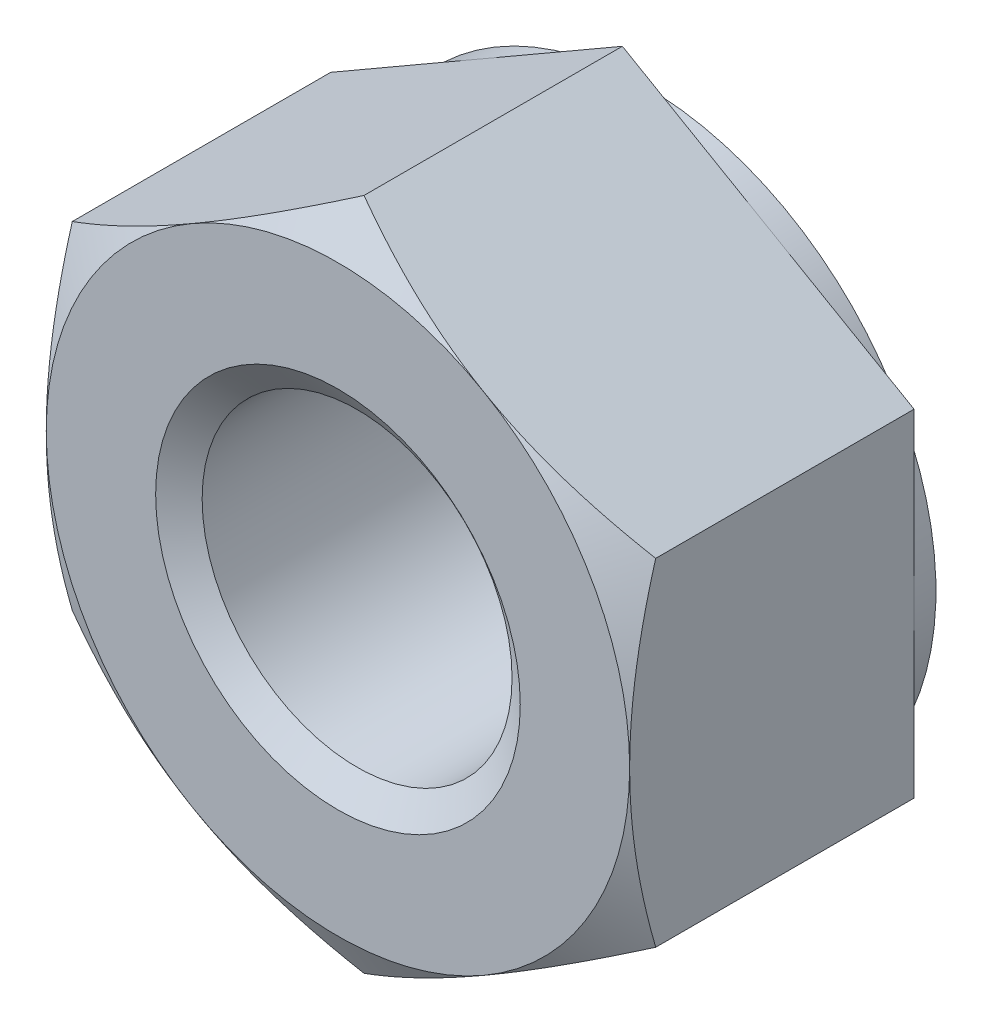
ISO-10303-21;
HEADER;
FILE_DESCRIPTION(('STEP AP214'),'2;1');
FILE_NAME('part.step','',(''),(''),'','','');
FILE_SCHEMA(('AUTOMOTIVE_DESIGN { 1 0 10303 214 1 1 1 1 }'));
ENDSEC;
DATA;
#1=APPLICATION_CONTEXT('core data for automotive mechanical design processes');
#2=APPLICATION_PROTOCOL_DEFINITION('international standard','automotive_design',2000,#1);
#3=PRODUCT_CONTEXT('',#1,'mechanical');
#4=PRODUCT('Part','Part','',(#3));
#5=PRODUCT_RELATED_PRODUCT_CATEGORY('part','',(#4));
#6=PRODUCT_DEFINITION_FORMATION('','',#4);
#7=PRODUCT_DEFINITION_CONTEXT('part definition',#1,'design');
#8=PRODUCT_DEFINITION('design','',#6,#7);
#9=PRODUCT_DEFINITION_SHAPE('','',#8);
#10=(LENGTH_UNIT() NAMED_UNIT(*) SI_UNIT(.MILLI.,.METRE.));
#11=(NAMED_UNIT(*) PLANE_ANGLE_UNIT() SI_UNIT($,.RADIAN.));
#12=(NAMED_UNIT(*) SI_UNIT($,.STERADIAN.) SOLID_ANGLE_UNIT());
#13=UNCERTAINTY_MEASURE_WITH_UNIT(LENGTH_MEASURE(1.E-05),#10,'distance_accuracy_value','');
#14=(GEOMETRIC_REPRESENTATION_CONTEXT(3) GLOBAL_UNCERTAINTY_ASSIGNED_CONTEXT((#13)) GLOBAL_UNIT_ASSIGNED_CONTEXT((#10,
#11,#12)) REPRESENTATION_CONTEXT('',''));
#15=CARTESIAN_POINT('',(0.,0.,0.));
#16=DIRECTION('',(0.,0.,1.));
#17=DIRECTION('',(1.,0.,0.));
#18=AXIS2_PLACEMENT_3D('',#15,#16,#17);
#19=CARTESIAN_POINT('',(0.,0.,-8.4));
#20=DIRECTION('',(0.,0.,1.));
#21=DIRECTION('',(1.,0.,0.));
#22=AXIS2_PLACEMENT_3D('',#19,#20,#21);
#23=CYLINDRICAL_SURFACE('',#22,4.25);
#24=CARTESIAN_POINT('',(0.,0.,-0.525155653657275));
#25=DIRECTION('',(0.,0.,1.));
#26=DIRECTION('',(1.,0.,0.));
#27=AXIS2_PLACEMENT_3D('',#24,#25,#26);
#28=CIRCLE('',#27,4.25);
#29=CARTESIAN_POINT('',(4.25,0.,-0.525155653657275));
#30=VERTEX_POINT('',#29);
#31=EDGE_CURVE('E153',#30,#30,#28,.F.);
#32=ORIENTED_EDGE('',*,*,#31,.F.);
#33=EDGE_LOOP('',(#32));
#34=FACE_BOUND('',#33,.T.);
#35=CARTESIAN_POINT('',(0.,0.,-7.84944434634271));
#36=DIRECTION('',(0.,0.,-1.));
#37=DIRECTION('',(-1.,0.,0.));
#38=AXIS2_PLACEMENT_3D('',#35,#36,#37);
#39=CIRCLE('',#38,4.25);
#40=CARTESIAN_POINT('',(-4.25,0.,-7.84944434634271));
#41=VERTEX_POINT('',#40);
#42=EDGE_CURVE('E41',#41,#41,#39,.F.);
#43=ORIENTED_EDGE('',*,*,#42,.F.);
#44=EDGE_LOOP('',(#43));
#45=FACE_BOUND('',#44,.T.);
#46=ADVANCED_FACE('F36',(#34,#45),#23,.F.);
#47=CARTESIAN_POINT('',(0.,9.23760430703403,-8.4));
#48=DIRECTION('',(-0.500000000000002,0.866025403784438,0.));
#49=DIRECTION('',(-0.866025403784438,-0.500000000000001,0.));
#50=AXIS2_PLACEMENT_3D('',#47,#48,#49);
#51=PLANE('',#50);
#52=DIRECTION('',(0.,0.,1.));
#53=VECTOR('',#52,1.);
#54=CARTESIAN_POINT('',(-8.,4.618802153517,-8.4));
#55=LINE('',#54,#53);
#56=CARTESIAN_POINT('',(-8.,4.618802153517,-7.8));
#57=VERTEX_POINT('',#56);
#58=CARTESIAN_POINT('',(-8.,4.618802153517,-0.714531179816336));
#59=VERTEX_POINT('',#58);
#60=EDGE_CURVE('E294',#57,#59,#55,.T.);
#61=ORIENTED_EDGE('',*,*,#60,.T.);
#62=CARTESIAN_POINT('',(-8.0002,4.61868668346316,-0.714597847732978));
#63=CARTESIAN_POINT('',(-7.8243512161201,4.72021302617289,-0.655990714047302));
#64=CARTESIAN_POINT('',(-7.64784680569387,4.82211789504563,-0.600043401047294));
#65=CARTESIAN_POINT('',(-7.29340453712154,5.02675523421805,-0.494201005024669));
#66=CARTESIAN_POINT('',(-7.11546609530729,5.12948804149869,-0.444308534431069));
#67=CARTESIAN_POINT('',(-6.57880176237736,5.43933133858026,-0.304692797206867));
#68=CARTESIAN_POINT('',(-6.21795741776428,5.64766491807817,-0.225281170978369));
#69=CARTESIAN_POINT('',(-5.67796082979595,5.95943209350317,-0.132161646294488));
#70=CARTESIAN_POINT('',(-5.50042181035672,6.06193429416807,-0.105634581029124));
#71=CARTESIAN_POINT('',(-5.1445408870398,6.26740224104455,-0.0611531748588751));
#72=CARTESIAN_POINT('',(-4.96619905550676,6.37036794548792,-0.0431980765145794));
#73=CARTESIAN_POINT('',(-4.60920831517641,6.57647664551585,-0.0163156484918648));
#74=CARTESIAN_POINT('',(-4.4305599863905,6.67961930623067,-0.00737807354623335));
#75=CARTESIAN_POINT('',(-4.07309829490262,6.88599991003618,0.00127769603487006));
#76=CARTESIAN_POINT('',(-3.89428493746993,6.98923785008464,0.000996175497150641));
#77=CARTESIAN_POINT('',(-3.5599866329831,7.18224506616975,-0.00814502526877564));
#78=CARTESIAN_POINT('',(-3.40447809566133,7.27202796205376,-0.0158896043673706));
#79=CARTESIAN_POINT('',(-3.09382523825949,7.45138347289924,-0.0382011348534298));
#80=CARTESIAN_POINT('',(-2.93868094344,7.54095607327651,-0.0527685461381488));
#81=CARTESIAN_POINT('',(-2.47384868410518,7.80932710333149,-0.106360690527538));
#82=CARTESIAN_POINT('',(-2.16498351281828,7.98765049311728,-0.155268641669147));
#83=CARTESIAN_POINT('',(-1.5439767712397,8.34618890253625,-0.277539403234319));
#84=CARTESIAN_POINT('',(-1.23191445788552,8.52635816315522,-0.351420520376005));
#85=CARTESIAN_POINT('',(-0.612443518305234,8.88400987687705,-0.51910014125498));
#86=CARTESIAN_POINT('',(-0.305026959108242,9.06149691008278,-0.612859260854464));
#87=CARTESIAN_POINT('',(0.000200000000006861,9.23771977708786,-0.714597847732986));
#88=B_SPLINE_CURVE_WITH_KNOTS('',3,(#62,#63,#64,#65,#66,#67,#68,#69,#70,#71,#72,#73,#74,#75,#76,
#77,#78,#79,#80,#81,#82,#83,#84,#85,#86,#87),.UNSPECIFIED.,.F.,.F.,(4,2,2,2,2,2,2,2,2,2,2,2,4),
(0.,0.633973543721351,1.26821965714356,2.53934712434766,3.15934343977049,3.77928496069784,
4.39852133866766,5.01773858515596,5.55680239410249,6.09590254421148,7.17487077411836,
8.27776850154294,9.37850115249056),.UNSPECIFIED.);
#89=CARTESIAN_POINT('',(-4.00000000000001,6.9282032302755,0.));
#90=VERTEX_POINT('',#89);
#91=EDGE_CURVE('E60',#59,#90,#88,.T.);
#92=ORIENTED_EDGE('',*,*,#91,.T.);
#93=CARTESIAN_POINT('',(0.,9.23760430703403,-0.714531179816336));
#94=VERTEX_POINT('',#93);
#95=EDGE_CURVE('E167',#90,#94,#88,.T.);
#96=ORIENTED_EDGE('',*,*,#95,.T.);
#97=DIRECTION('',(0.,0.,1.));
#98=VECTOR('',#97,1.);
#99=CARTESIAN_POINT('',(0.,9.23760430703403,-8.4));
#100=LINE('',#99,#98);
#101=CARTESIAN_POINT('',(0.,9.23760430703403,-7.8));
#102=VERTEX_POINT('',#101);
#103=EDGE_CURVE('E282',#102,#94,#100,.T.);
#104=ORIENTED_EDGE('',*,*,#103,.F.);
#105=DIRECTION('',(-0.866025403784438,-0.500000000000001,0.));
#106=VECTOR('',#105,1.);
#107=CARTESIAN_POINT('',(0.,9.23760430703403,-7.8));
#108=LINE('',#107,#106);
#109=CARTESIAN_POINT('',(-4.00000000000001,6.9282032302755,-7.80000000000001));
#110=VERTEX_POINT('',#109);
#111=EDGE_CURVE('E270',#102,#110,#108,.T.);
#112=ORIENTED_EDGE('',*,*,#111,.T.);
#113=EDGE_CURVE('E266',#110,#57,#108,.T.);
#114=ORIENTED_EDGE('',*,*,#113,.T.);
#115=EDGE_LOOP('',(#61,#92,#96,#104,#112,#114));
#116=FACE_BOUND('',#115,.T.);
#117=ADVANCED_FACE('F38',(#116),#51,.T.);
#118=CARTESIAN_POINT('',(8.,4.61880215351699,-8.4));
#119=DIRECTION('',(0.500000000000003,0.866025403784437,0.));
#120=DIRECTION('',(-0.866025403784437,0.500000000000003,0.));
#121=AXIS2_PLACEMENT_3D('',#118,#119,#120);
#122=PLANE('',#121);
#123=ORIENTED_EDGE('',*,*,#103,.T.);
#124=CARTESIAN_POINT('',(-0.000199999999993257,9.23771977708786,-0.714597847732987));
#125=CARTESIAN_POINT('',(0.175648783879903,9.13619343437814,-0.655990714047311));
#126=CARTESIAN_POINT('',(0.352153194306141,9.03428856550539,-0.600043401047303));
#127=CARTESIAN_POINT('',(0.706595462878466,8.82965122633298,-0.494201005024678));
#128=CARTESIAN_POINT('',(0.884533904692719,8.72691841905234,-0.444308534431077));
#129=CARTESIAN_POINT('',(1.42119823762265,8.41707512197076,-0.304692797206873));
#130=CARTESIAN_POINT('',(1.78204258223573,8.20874154247285,-0.225281170978374));
#131=CARTESIAN_POINT('',(2.32203917020406,7.89697436704785,-0.132161646294492));
#132=CARTESIAN_POINT('',(2.49957818964329,7.79447216638295,-0.105634581029128));
#133=CARTESIAN_POINT('',(2.85545911296021,7.58900421950647,-0.0611531748588782));
#134=CARTESIAN_POINT('',(3.03380094449325,7.4860385150631,-0.043198076514582));
#135=CARTESIAN_POINT('',(3.3907916848236,7.27992981503516,-0.0163156484918658));
#136=CARTESIAN_POINT('',(3.56944001360951,7.17678715432034,-0.00737807354623321));
#137=CARTESIAN_POINT('',(3.92690170509739,6.97040655051483,0.00127769603487092));
#138=CARTESIAN_POINT('',(4.10571506253007,6.86716861046637,0.000996175497151138));
#139=CARTESIAN_POINT('',(4.44001336701691,6.67416139438126,-0.00814502526877416));
#140=CARTESIAN_POINT('',(4.59552190433868,6.58437849849725,-0.0158896043673679));
#141=CARTESIAN_POINT('',(4.90617476174052,6.40502298765177,-0.038201134853426));
#142=CARTESIAN_POINT('',(5.06131905656001,6.31545038727451,-0.0527685461381451));
#143=CARTESIAN_POINT('',(5.52615131589482,6.04707935721953,-0.106360690527534));
#144=CARTESIAN_POINT('',(5.83501648718173,5.86875596743373,-0.155268641669143));
#145=CARTESIAN_POINT('',(6.45602322876031,5.51021755801476,-0.277539403234312));
#146=CARTESIAN_POINT('',(6.76808554211448,5.33004829739579,-0.351420520375997));
#147=CARTESIAN_POINT('',(7.38755648169477,4.97239658367396,-0.519100141254969));
#148=CARTESIAN_POINT('',(7.69497304089176,4.79490955046823,-0.612859260854453));
#149=CARTESIAN_POINT('',(8.00020000000001,4.61868668346315,-0.714597847732975));
#150=B_SPLINE_CURVE_WITH_KNOTS('',3,(#124,#125,#126,#127,#128,#129,#130,#131,#132,#133,#134,
#135,#136,#137,#138,#139,#140,#141,#142,#143,#144,#145,#146,#147,#148,#149),.UNSPECIFIED.,.F.,
.F.,(4,2,2,2,2,2,2,2,2,2,2,2,4),(0.,0.633973543721352,1.26821965714356,2.53934712434766,
3.1593434397705,3.77928496069785,4.39852133866767,5.01773858515596,5.5568023941025,
6.09590254421149,7.17487077411836,8.27776850154294,9.37850115249056),.UNSPECIFIED.);
#151=CARTESIAN_POINT('',(4.00000000000002,6.9282032302755,0.));
#152=VERTEX_POINT('',#151);
#153=EDGE_CURVE('E164',#94,#152,#150,.T.);
#154=ORIENTED_EDGE('',*,*,#153,.T.);
#155=CARTESIAN_POINT('',(8.,4.61880215351703,-0.714531179816336));
#156=VERTEX_POINT('',#155);
#157=EDGE_CURVE('E147',#152,#156,#150,.T.);
#158=ORIENTED_EDGE('',*,*,#157,.T.);
#159=DIRECTION('',(0.,0.,1.));
#160=VECTOR('',#159,1.);
#161=CARTESIAN_POINT('',(8.,4.61880215351699,-8.4));
#162=LINE('',#161,#160);
#163=CARTESIAN_POINT('',(8.,4.61880215351699,-7.8));
#164=VERTEX_POINT('',#163);
#165=EDGE_CURVE('E163',#164,#156,#162,.T.);
#166=ORIENTED_EDGE('',*,*,#165,.F.);
#167=DIRECTION('',(-0.866025403784437,0.500000000000003,0.));
#168=VECTOR('',#167,1.);
#169=CARTESIAN_POINT('',(8.,4.61880215351699,-7.8));
#170=LINE('',#169,#168);
#171=CARTESIAN_POINT('',(4.00000000000002,6.9282032302755,-7.80000000000001));
#172=VERTEX_POINT('',#171);
#173=EDGE_CURVE('E278',#164,#172,#170,.T.);
#174=ORIENTED_EDGE('',*,*,#173,.T.);
#175=EDGE_CURVE('E274',#172,#102,#170,.T.);
#176=ORIENTED_EDGE('',*,*,#175,.T.);
#177=EDGE_LOOP('',(#123,#154,#158,#166,#174,#176));
#178=FACE_BOUND('',#177,.T.);
#179=ADVANCED_FACE('F241',(#178),#122,.T.);
#180=CARTESIAN_POINT('',(8.,4.61880215351699,-8.4));
#181=DIRECTION('',(-1.,0.,0.));
#182=DIRECTION('',(0.,0.,1.));
#183=AXIS2_PLACEMENT_3D('',#180,#181,#182);
#184=PLANE('',#183);
#185=CARTESIAN_POINT('',(8.,-12.2497439799177,-3.82821364248122));
#186=CARTESIAN_POINT('',(8.,-11.8984987351193,-3.65847254218266));
#187=CARTESIAN_POINT('',(8.,-11.5464230390783,-3.49041880793923));
#188=CARTESIAN_POINT('',(8.,-10.8401616983868,-3.15865029326974));
#189=CARTESIAN_POINT('',(8.,-10.4859757012546,-2.99493626408528));
#190=CARTESIAN_POINT('',(8.,-9.77313142803814,-2.67194892676994));
#191=CARTESIAN_POINT('',(8.,-9.41445915782848,-2.51270639241668));
#192=CARTESIAN_POINT('',(8.,-8.69416671490287,-2.20106116855006));
#193=CARTESIAN_POINT('',(8.,-8.33254669701139,-2.04865812250699));
#194=CARTESIAN_POINT('',(8.,-7.60129405984857,-1.7507013094022));
#195=CARTESIAN_POINT('',(8.,-7.2316175748596,-1.60525460075004));
#196=CARTESIAN_POINT('',(8.,-6.48790521752629,-1.32575242959684));
#197=CARTESIAN_POINT('',(8.,-6.11386886541895,-1.19169823445334));
#198=CARTESIAN_POINT('',(8.,-5.36160531585215,-0.938583617279796));
#199=CARTESIAN_POINT('',(8.,-4.98338896232053,-0.819491318535674));
#200=CARTESIAN_POINT('',(8.,-4.2215930034141,-0.600166264263341));
#201=CARTESIAN_POINT('',(8.,-3.83801513546607,-0.499927544676865));
#202=CARTESIAN_POINT('',(8.,-3.06517005833209,-0.323183265030146));
#203=CARTESIAN_POINT('',(8.,-2.67590136311897,-0.246684024227884));
#204=CARTESIAN_POINT('',(8.,-2.08857290362252,-0.153570158514917));
#205=CARTESIAN_POINT('',(8.,-1.89220175174279,-0.126136015174347));
#206=CARTESIAN_POINT('',(8.,-1.49853877384916,-0.0790191845115878));
#207=CARTESIAN_POINT('',(8.,-1.3012470409403,-0.0593357297923793));
#208=CARTESIAN_POINT('',(8.,-0.907261125171482,-0.0282499846394219));
#209=CARTESIAN_POINT('',(8.,-0.710571016085392,-0.0167962708107608));
#210=CARTESIAN_POINT('',(8.,-0.316882268583081,-0.0022305633436852));
#211=CARTESIAN_POINT('',(8.,-0.119883634206744,0.000881538622463729));
#212=CARTESIAN_POINT('',(8.,0.274012171056974,-0.00131013187964857));
#213=CARTESIAN_POINT('',(8.,0.47090935490336,-0.00661154245623651));
#214=CARTESIAN_POINT('',(8.,0.8643086583796,-0.0254984060979545));
#215=CARTESIAN_POINT('',(8.,1.06081075778876,-0.0390842728575164));
#216=CARTESIAN_POINT('',(8.,1.53707134445822,-0.0817685231184888));
#217=CARTESIAN_POINT('',(8.,1.81646391313846,-0.115017715431789));
#218=CARTESIAN_POINT('',(8.,2.37310809107455,-0.196418304991677));
#219=CARTESIAN_POINT('',(8.,2.65035909476176,-0.244573769774452));
#220=CARTESIAN_POINT('',(8.,3.20249141370949,-0.354078983931477));
#221=CARTESIAN_POINT('',(8.,3.47737023104608,-0.41544120858484));
#222=CARTESIAN_POINT('',(8.,4.02429975324249,-0.549487708331676));
#223=CARTESIAN_POINT('',(8.,4.29635072195127,-0.622170916833577));
#224=CARTESIAN_POINT('',(8.,4.84432510211611,-0.779020451442163));
#225=CARTESIAN_POINT('',(8.,5.12017997476409,-0.863424582160065));
#226=CARTESIAN_POINT('',(8.,5.6689739270833,-1.04057245964238));
#227=CARTESIAN_POINT('',(8.,5.94191487461246,-1.13331045423936));
#228=CARTESIAN_POINT('',(8.,6.48378576423056,-1.32521046517734));
#229=CARTESIAN_POINT('',(8.,6.7527296356523,-1.42433338468805));
#230=CARTESIAN_POINT('',(8.,7.28853074702745,-1.628397174615));
#231=CARTESIAN_POINT('',(8.,7.55538709319937,-1.73334039644852));
#232=CARTESIAN_POINT('',(8.,7.82127397973352,-1.84061801308352));
#233=B_SPLINE_CURVE_WITH_KNOTS('',3,(#185,#186,#187,#188,#189,#190,#191,#192,#193,#194,#195,
#196,#197,#198,#199,#200,#201,#202,#203,#204,#205,#206,#207,#208,#209,#210,#211,#212,#213,#214,
#215,#216,#217,#218,#219,#220,#221,#222,#223,#224,#225,#226,#227,#228,#229,#230,#231,#232),
.UNSPECIFIED.,.F.,.F.,(4,2,2,2,2,2,2,2,2,2,2,2,2,2,2,2,2,2,2,2,2,2,2,4),(0.,1.17034358506454,
2.3408884611985,3.51813189291972,4.69531388569647,5.88694801994964,7.07871454421368,
8.26789729395172,9.45670322782929,10.6458253413567,11.2405311012284,11.8351779643657,
12.4260760875167,13.0169665369752,13.6076911374644,14.1984452389235,15.0420672118768,
15.8859195906795,16.7305726096943,17.5751460989191,18.4404219096463,19.3051050140239,
20.1649211009824,21.0250871227256),.UNSPECIFIED.);
#234=CARTESIAN_POINT('',(7.99999999999999,-4.61880215351705,-0.714531179816336));
#235=VERTEX_POINT('',#234);
#236=CARTESIAN_POINT('',(8.,0.,0.));
#237=VERTEX_POINT('',#236);
#238=EDGE_CURVE('E128',#235,#237,#233,.T.);
#239=ORIENTED_EDGE('',*,*,#238,.F.);
#240=DIRECTION('',(0.,0.,1.));
#241=VECTOR('',#240,1.);
#242=CARTESIAN_POINT('',(8.,-4.61880215351704,-8.4));
#243=LINE('',#242,#241);
#244=CARTESIAN_POINT('',(8.,-4.61880215351704,-7.8));
#245=VERTEX_POINT('',#244);
#246=EDGE_CURVE('E287',#245,#235,#243,.T.);
#247=ORIENTED_EDGE('',*,*,#246,.F.);
#248=DIRECTION('',(0.,-1.,0.));
#249=VECTOR('',#248,1.);
#250=CARTESIAN_POINT('',(8.,4.61880215351699,-7.8));
#251=LINE('',#250,#249);
#252=CARTESIAN_POINT('',(8.,0.,-7.80000000000001));
#253=VERTEX_POINT('',#252);
#254=EDGE_CURVE('E279',#253,#245,#251,.T.);
#255=ORIENTED_EDGE('',*,*,#254,.F.);
#256=EDGE_CURVE('E281',#164,#253,#251,.T.);
#257=ORIENTED_EDGE('',*,*,#256,.F.);
#258=ORIENTED_EDGE('',*,*,#165,.T.);
#259=EDGE_CURVE('E141',#237,#156,#233,.T.);
#260=ORIENTED_EDGE('',*,*,#259,.F.);
#261=EDGE_LOOP('',(#239,#247,#255,#257,#258,#260));
#262=FACE_BOUND('',#261,.T.);
#263=ADVANCED_FACE('F160',(#262),#184,.F.);
#264=CARTESIAN_POINT('',(0.,-9.23760430703406,-8.4));
#265=DIRECTION('',(0.500000000000001,-0.866025403784438,0.));
#266=DIRECTION('',(0.866025403784438,0.500000000000001,0.));
#267=AXIS2_PLACEMENT_3D('',#264,#265,#266);
#268=PLANE('',#267);
#269=ORIENTED_EDGE('',*,*,#246,.T.);
#270=CARTESIAN_POINT('',(8.0002,-4.6186866834632,-0.714597847732991));
#271=CARTESIAN_POINT('',(7.82435121612011,-4.72021302617293,-0.655990714047315));
#272=CARTESIAN_POINT('',(7.64784680569387,-4.82211789504567,-0.600043401047307));
#273=CARTESIAN_POINT('',(7.29340453712154,-5.02675523421809,-0.494201005024683));
#274=CARTESIAN_POINT('',(7.11546609530729,-5.12948804149873,-0.444308534431083));
#275=CARTESIAN_POINT('',(6.57880176237736,-5.4393313385803,-0.304692797206883));
#276=CARTESIAN_POINT('',(6.21795741776428,-5.64766491807822,-0.225281170978385));
#277=CARTESIAN_POINT('',(5.67796082979595,-5.95943209350321,-0.132161646294506));
#278=CARTESIAN_POINT('',(5.50042181035671,-6.06193429416812,-0.105634581029142));
#279=CARTESIAN_POINT('',(5.1445408870398,-6.26740224104459,-0.0611531748588941));
#280=CARTESIAN_POINT('',(4.96619905550675,-6.37036794548796,-0.0431980765145988));
#281=CARTESIAN_POINT('',(4.6092083151764,-6.5764766455159,-0.0163156484918844));
#282=CARTESIAN_POINT('',(4.43055998639049,-6.67961930623072,-0.00737807354625267));
#283=CARTESIAN_POINT('',(4.07309829490261,-6.88599991003623,0.00127769603484983));
#284=CARTESIAN_POINT('',(3.89428493746993,-6.98923785008469,0.000996175497129205));
#285=CARTESIAN_POINT('',(3.55998663298309,-7.1822450661698,-0.00814502526879815));
#286=CARTESIAN_POINT('',(3.40447809566132,-7.27202796205381,-0.015889604367393));
#287=CARTESIAN_POINT('',(3.09382523825948,-7.45138347289929,-0.0382011348534525));
#288=CARTESIAN_POINT('',(2.93868094343999,-7.54095607327656,-0.0527685461381717));
#289=CARTESIAN_POINT('',(2.47384868410518,-7.80932710333153,-0.106360690527561));
#290=CARTESIAN_POINT('',(2.16498351281827,-7.98765049311733,-0.155268641669171));
#291=CARTESIAN_POINT('',(1.5439767712397,-8.34618890253629,-0.277539403234343));
#292=CARTESIAN_POINT('',(1.23191445788552,-8.52635816315526,-0.351420520376029));
#293=CARTESIAN_POINT('',(0.612443518305239,-8.88400987687709,-0.519100141255002));
#294=CARTESIAN_POINT('',(0.305026959108248,-9.06149691008282,-0.612859260854486));
#295=CARTESIAN_POINT('',(-0.000200000000000978,-9.2377197770879,-0.714597847733008));
#296=B_SPLINE_CURVE_WITH_KNOTS('',3,(#270,#271,#272,#273,#274,#275,#276,#277,#278,#279,#280,
#281,#282,#283,#284,#285,#286,#287,#288,#289,#290,#291,#292,#293,#294,#295),.UNSPECIFIED.,.F.,
.F.,(4,2,2,2,2,2,2,2,2,2,2,2,4),(0.,0.633973543721352,1.26821965714356,2.53934712434767,
3.1593434397705,3.77928496069785,4.39852133866767,5.01773858515597,5.5568023941025,
6.09590254421149,7.17487077411836,8.27776850154294,9.37850115249056),.UNSPECIFIED.);
#297=CARTESIAN_POINT('',(4.00000000000001,-6.9282032302755,0.));
#298=VERTEX_POINT('',#297);
#299=EDGE_CURVE('E135',#235,#298,#296,.T.);
#300=ORIENTED_EDGE('',*,*,#299,.T.);
#301=CARTESIAN_POINT('',(0.,-9.23760430703403,-0.714531179816336));
#302=VERTEX_POINT('',#301);
#303=EDGE_CURVE('E175',#298,#302,#296,.T.);
#304=ORIENTED_EDGE('',*,*,#303,.T.);
#305=DIRECTION('',(0.,0.,1.));
#306=VECTOR('',#305,1.);
#307=CARTESIAN_POINT('',(0.,-9.23760430703406,-8.4));
#308=LINE('',#307,#306);
#309=CARTESIAN_POINT('',(0.,-9.23760430703406,-7.8));
#310=VERTEX_POINT('',#309);
#311=EDGE_CURVE('E289',#310,#302,#308,.T.);
#312=ORIENTED_EDGE('',*,*,#311,.F.);
#313=DIRECTION('',(0.866025403784438,0.500000000000001,0.));
#314=VECTOR('',#313,1.);
#315=CARTESIAN_POINT('',(0.,-9.23760430703406,-7.8));
#316=LINE('',#315,#314);
#317=CARTESIAN_POINT('',(4.00000000000003,-6.92820323027554,-7.80000000000001));
#318=VERTEX_POINT('',#317);
#319=EDGE_CURVE('E271',#310,#318,#316,.T.);
#320=ORIENTED_EDGE('',*,*,#319,.T.);
#321=EDGE_CURVE('E275',#318,#245,#316,.T.);
#322=ORIENTED_EDGE('',*,*,#321,.T.);
#323=EDGE_LOOP('',(#269,#300,#304,#312,#320,#322));
#324=FACE_BOUND('',#323,.T.);
#325=ADVANCED_FACE('F222',(#324),#268,.T.);
#326=CARTESIAN_POINT('',(-8.,-4.61880215351703,-8.4));
#327=DIRECTION('',(-0.500000000000003,-0.866025403784437,0.));
#328=DIRECTION('',(0.866025403784437,-0.500000000000003,0.));
#329=AXIS2_PLACEMENT_3D('',#326,#327,#328);
#330=PLANE('',#329);
#331=ORIENTED_EDGE('',*,*,#311,.T.);
#332=CARTESIAN_POINT('',(0.000199999999998451,-9.23771977708791,-0.714597847733011));
#333=CARTESIAN_POINT('',(-0.175648783879898,-9.13619343437818,-0.655990714047334));
#334=CARTESIAN_POINT('',(-0.352153194306137,-9.03428856550543,-0.600043401047325));
#335=CARTESIAN_POINT('',(-0.706595462878463,-8.82965122633301,-0.494201005024699));
#336=CARTESIAN_POINT('',(-0.884533904692716,-8.72691841905237,-0.444308534431099));
#337=CARTESIAN_POINT('',(-1.42119823762265,-8.4170751219708,-0.304692797206895));
#338=CARTESIAN_POINT('',(-1.78204258223573,-8.20874154247288,-0.225281170978394));
#339=CARTESIAN_POINT('',(-2.32203917020406,-7.89697436704789,-0.132161646294512));
#340=CARTESIAN_POINT('',(-2.4995781896433,-7.79447216638298,-0.105634581029147));
#341=CARTESIAN_POINT('',(-2.85545911296021,-7.58900421950651,-0.0611531748588975));
#342=CARTESIAN_POINT('',(-3.03380094449325,-7.48603851506313,-0.0431980765146008));
#343=CARTESIAN_POINT('',(-3.39079168482361,-7.2799298150352,-0.0163156484918845));
#344=CARTESIAN_POINT('',(-3.56944001360952,-7.17678715432037,-0.00737807354625216));
#345=CARTESIAN_POINT('',(-3.9269017050974,-6.97040655051486,0.00127769603485182));
#346=CARTESIAN_POINT('',(-4.10571506253009,-6.8671686104664,0.00099617549713211));
#347=CARTESIAN_POINT('',(-4.44001336701692,-6.67416139438129,-0.00814502526879339));
#348=CARTESIAN_POINT('',(-4.59552190433869,-6.58437849849728,-0.0158896043673873));
#349=CARTESIAN_POINT('',(-4.90617476174053,-6.4050229876518,-0.0382011348534452));
#350=CARTESIAN_POINT('',(-5.06131905656002,-6.31545038727454,-0.0527685461381638));
#351=CARTESIAN_POINT('',(-5.52615131589483,-6.04707935721956,-0.106360690527551));
#352=CARTESIAN_POINT('',(-5.83501648718173,-5.86875596743377,-0.155268641669158));
#353=CARTESIAN_POINT('',(-6.45602322876031,-5.5102175580148,-0.277539403234326));
#354=CARTESIAN_POINT('',(-6.76808554211448,-5.33004829739583,-0.351420520376012));
#355=CARTESIAN_POINT('',(-7.38755648169476,-4.972396583674,-0.519100141254983));
#356=CARTESIAN_POINT('',(-7.69497304089175,-4.79490955046827,-0.612859260854466));
#357=CARTESIAN_POINT('',(-8.0002,-4.61868668346319,-0.714597847732985));
#358=B_SPLINE_CURVE_WITH_KNOTS('',3,(#332,#333,#334,#335,#336,#337,#338,#339,#340,#341,#342,
#343,#344,#345,#346,#347,#348,#349,#350,#351,#352,#353,#354,#355,#356,#357),.UNSPECIFIED.,.F.,
.F.,(4,2,2,2,2,2,2,2,2,2,2,2,4),(0.,0.633973543721355,1.26821965714357,2.53934712434768,
3.15934343977051,3.77928496069786,4.39852133866769,5.01773858515599,5.55680239410252,
6.09590254421151,7.17487077411837,8.27776850154295,9.37850115249056),.UNSPECIFIED.);
#359=CARTESIAN_POINT('',(-4.00000000000002,-6.9282032302755,0.));
#360=VERTEX_POINT('',#359);
#361=EDGE_CURVE('E216',#302,#360,#358,.T.);
#362=ORIENTED_EDGE('',*,*,#361,.T.);
#363=CARTESIAN_POINT('',(-8.,-4.61880215351704,-0.714531179816336));
#364=VERTEX_POINT('',#363);
#365=EDGE_CURVE('E208',#360,#364,#358,.T.);
#366=ORIENTED_EDGE('',*,*,#365,.T.);
#367=DIRECTION('',(0.,0.,1.));
#368=VECTOR('',#367,1.);
#369=CARTESIAN_POINT('',(-8.,-4.61880215351703,-8.4));
#370=LINE('',#369,#368);
#371=CARTESIAN_POINT('',(-8.,-4.61880215351703,-7.8));
#372=VERTEX_POINT('',#371);
#373=EDGE_CURVE('E292',#372,#364,#370,.T.);
#374=ORIENTED_EDGE('',*,*,#373,.F.);
#375=DIRECTION('',(0.866025403784437,-0.500000000000003,0.));
#376=VECTOR('',#375,1.);
#377=CARTESIAN_POINT('',(-8.,-4.61880215351703,-7.8));
#378=LINE('',#377,#376);
#379=CARTESIAN_POINT('',(-4.00000000000004,-6.92820323027553,-7.80000000000001));
#380=VERTEX_POINT('',#379);
#381=EDGE_CURVE('E261',#372,#380,#378,.T.);
#382=ORIENTED_EDGE('',*,*,#381,.T.);
#383=EDGE_CURVE('E267',#380,#310,#378,.T.);
#384=ORIENTED_EDGE('',*,*,#383,.T.);
#385=EDGE_LOOP('',(#331,#362,#366,#374,#382,#384));
#386=FACE_BOUND('',#385,.T.);
#387=ADVANCED_FACE('F218',(#386),#330,.T.);
#388=CARTESIAN_POINT('',(-8.,4.618802153517,-8.4));
#389=DIRECTION('',(-1.,0.,0.));
#390=DIRECTION('',(0.,0.,1.));
#391=AXIS2_PLACEMENT_3D('',#388,#389,#390);
#392=PLANE('',#391);
#393=ORIENTED_EDGE('',*,*,#373,.T.);
#394=CARTESIAN_POINT('',(-8.,-12.2497439799177,-3.82821364248122));
#395=CARTESIAN_POINT('',(-8.,-11.8984987351192,-3.65847254218265));
#396=CARTESIAN_POINT('',(-8.,-11.5464230390783,-3.49041880793922));
#397=CARTESIAN_POINT('',(-8.,-10.8401616983868,-3.15865029326972));
#398=CARTESIAN_POINT('',(-8.,-10.4859757012545,-2.99493626408527));
#399=CARTESIAN_POINT('',(-8.,-9.77313142803813,-2.67194892676993));
#400=CARTESIAN_POINT('',(-8.,-9.41445915782846,-2.51270639241668));
#401=CARTESIAN_POINT('',(-8.,-8.69416671490286,-2.20106116855005));
#402=CARTESIAN_POINT('',(-8.,-8.33254669701137,-2.04865812250698));
#403=CARTESIAN_POINT('',(-8.,-7.60129405984856,-1.75070130940219));
#404=CARTESIAN_POINT('',(-8.,-7.2316175748596,-1.60525460075003));
#405=CARTESIAN_POINT('',(-8.,-6.48790521752628,-1.32575242959684));
#406=CARTESIAN_POINT('',(-8.,-6.11386886541894,-1.19169823445333));
#407=CARTESIAN_POINT('',(-8.,-5.36160531585214,-0.938583617279791));
#408=CARTESIAN_POINT('',(-8.,-4.98338896232052,-0.819491318535668));
#409=CARTESIAN_POINT('',(-8.,-4.22159300341409,-0.600166264263335));
#410=CARTESIAN_POINT('',(-8.,-3.83801513546606,-0.49992754467686));
#411=CARTESIAN_POINT('',(-8.,-3.06517005833208,-0.323183265030141));
#412=CARTESIAN_POINT('',(-8.,-2.67590136311896,-0.246684024227879));
#413=CARTESIAN_POINT('',(-8.,-2.08857290362251,-0.153570158514913));
#414=CARTESIAN_POINT('',(-8.,-1.89220175174278,-0.126136015174344));
#415=CARTESIAN_POINT('',(-8.,-1.49853877384915,-0.0790191845115847));
#416=CARTESIAN_POINT('',(-8.,-1.30124704094029,-0.0593357297923754));
#417=CARTESIAN_POINT('',(-8.,-0.907261125171473,-0.0282499846394178));
#418=CARTESIAN_POINT('',(-8.,-0.710571016085383,-0.0167962708107576));
#419=CARTESIAN_POINT('',(-8.,-0.316882268583073,-0.00223056334368244));
#420=CARTESIAN_POINT('',(-8.,-0.119883634206737,0.000881538622466866));
#421=CARTESIAN_POINT('',(-8.,0.27401217105698,-0.00131013187964569));
#422=CARTESIAN_POINT('',(-8.,0.470909354903366,-0.00661154245623428));
#423=CARTESIAN_POINT('',(-8.,0.864308658379605,-0.0254984060979528));
#424=CARTESIAN_POINT('',(-8.,1.06081075778876,-0.0390842728575145));
#425=CARTESIAN_POINT('',(-8.,1.53707134445823,-0.0817685231184867));
#426=CARTESIAN_POINT('',(-8.,1.81646391313847,-0.115017715431787));
#427=CARTESIAN_POINT('',(-8.,2.37310809107455,-0.196418304991675));
#428=CARTESIAN_POINT('',(-8.,2.65035909476177,-0.244573769774451));
#429=CARTESIAN_POINT('',(-8.,3.2024914137095,-0.354078983931476));
#430=CARTESIAN_POINT('',(-8.,3.47737023104609,-0.415441208584839));
#431=CARTESIAN_POINT('',(-8.,4.0242997532425,-0.549487708331675));
#432=CARTESIAN_POINT('',(-8.,4.29635072195127,-0.622170916833575));
#433=CARTESIAN_POINT('',(-8.,4.84432510211611,-0.779020451442161));
#434=CARTESIAN_POINT('',(-8.,5.1201799747641,-0.863424582160063));
#435=CARTESIAN_POINT('',(-8.,5.6689739270833,-1.04057245964238));
#436=CARTESIAN_POINT('',(-8.,5.94191487461246,-1.13331045423935));
#437=CARTESIAN_POINT('',(-8.,6.48378576423056,-1.32521046517734));
#438=CARTESIAN_POINT('',(-8.,6.7527296356523,-1.42433338468805));
#439=CARTESIAN_POINT('',(-8.,7.28853074702746,-1.628397174615));
#440=CARTESIAN_POINT('',(-8.,7.55538709319938,-1.73334039644852));
#441=CARTESIAN_POINT('',(-8.,7.82127397973352,-1.84061801308352));
#442=B_SPLINE_CURVE_WITH_KNOTS('',3,(#394,#395,#396,#397,#398,#399,#400,#401,#402,#403,#404,
#405,#406,#407,#408,#409,#410,#411,#412,#413,#414,#415,#416,#417,#418,#419,#420,#421,#422,#423,
#424,#425,#426,#427,#428,#429,#430,#431,#432,#433,#434,#435,#436,#437,#438,#439,#440,#441),
.UNSPECIFIED.,.F.,.F.,(4,2,2,2,2,2,2,2,2,2,2,2,2,2,2,2,2,2,2,2,2,2,2,4),(0.,1.17034358506454,
2.3408884611985,3.51813189291972,4.69531388569646,5.88694801994963,7.07871454421368,
8.26789729395171,9.45670322782928,10.6458253413567,11.2405311012284,11.8351779643657,
12.4260760875167,13.0169665369752,13.6076911374644,14.1984452389235,15.0420672118768,
15.8859195906795,16.7305726096943,17.5751460989191,18.4404219096463,19.3051050140239,
20.1649211009824,21.0250871227256),.UNSPECIFIED.);
#443=CARTESIAN_POINT('',(-8.,0.,0.));
#444=VERTEX_POINT('',#443);
#445=EDGE_CURVE('E217',#364,#444,#442,.T.);
#446=ORIENTED_EDGE('',*,*,#445,.T.);
#447=EDGE_CURVE('E152',#444,#59,#442,.T.);
#448=ORIENTED_EDGE('',*,*,#447,.T.);
#449=ORIENTED_EDGE('',*,*,#60,.F.);
#450=DIRECTION('',(0.,-1.,0.));
#451=VECTOR('',#450,1.);
#452=CARTESIAN_POINT('',(-8.,4.618802153517,-7.8));
#453=LINE('',#452,#451);
#454=CARTESIAN_POINT('',(-8.,0.,-7.80000000000001));
#455=VERTEX_POINT('',#454);
#456=EDGE_CURVE('E301',#57,#455,#453,.T.);
#457=ORIENTED_EDGE('',*,*,#456,.T.);
#458=EDGE_CURVE('E299',#455,#372,#453,.T.);
#459=ORIENTED_EDGE('',*,*,#458,.T.);
#460=EDGE_LOOP('',(#393,#446,#448,#449,#457,#459));
#461=FACE_BOUND('',#460,.T.);
#462=ADVANCED_FACE('F221',(#461),#392,.T.);
#463=CARTESIAN_POINT('',(0.,9.23760430703403,0.));
#464=DIRECTION('',(0.,0.,-1.));
#465=DIRECTION('',(-1.,0.,0.));
#466=AXIS2_PLACEMENT_3D('',#463,#464,#465);
#467=PLANE('',#466);
#468=CARTESIAN_POINT('',(0.,0.,0.));
#469=DIRECTION('',(0.,0.,1.));
#470=DIRECTION('',(1.,0.,0.));
#471=AXIS2_PLACEMENT_3D('',#468,#469,#470);
#472=CIRCLE('',#471,5.);
#473=CARTESIAN_POINT('',(5.,0.,0.));
#474=VERTEX_POINT('',#473);
#475=EDGE_CURVE('E304',#474,#474,#472,.T.);
#476=ORIENTED_EDGE('',*,*,#475,.F.);
#477=EDGE_LOOP('',(#476));
#478=FACE_BOUND('',#477,.T.);
#479=CARTESIAN_POINT('',(0.,0.,0.));
#480=DIRECTION('',(0.,0.,-1.));
#481=DIRECTION('',(-1.,0.,0.));
#482=AXIS2_PLACEMENT_3D('',#479,#480,#481);
#483=CIRCLE('',#482,8.);
#484=EDGE_CURVE('E48',#90,#444,#483,.F.);
#485=ORIENTED_EDGE('',*,*,#484,.T.);
#486=EDGE_CURVE('E12',#444,#360,#483,.F.);
#487=ORIENTED_EDGE('',*,*,#486,.T.);
#488=EDGE_CURVE('E46',#360,#298,#483,.F.);
#489=ORIENTED_EDGE('',*,*,#488,.T.);
#490=EDGE_CURVE('E132',#298,#237,#483,.F.);
#491=ORIENTED_EDGE('',*,*,#490,.T.);
#492=CARTESIAN_POINT('',(0.,0.,0.));
#493=DIRECTION('',(0.,0.,1.));
#494=DIRECTION('',(1.,0.,0.));
#495=AXIS2_PLACEMENT_3D('',#492,#493,#494);
#496=CIRCLE('',#495,8.);
#497=EDGE_CURVE('E144',#237,#152,#496,.T.);
#498=ORIENTED_EDGE('',*,*,#497,.T.);
#499=EDGE_CURVE('E158',#152,#90,#483,.F.);
#500=ORIENTED_EDGE('',*,*,#499,.T.);
#501=EDGE_LOOP('',(#485,#487,#489,#491,#498,#500));
#502=FACE_BOUND('',#501,.T.);
#503=ADVANCED_FACE('F156',(#478,#502),#467,.F.);
#504=CARTESIAN_POINT('',(0.,9.23760430703403,-8.4));
#505=DIRECTION('',(0.,0.,-1.));
#506=DIRECTION('',(-1.,0.,0.));
#507=AXIS2_PLACEMENT_3D('',#504,#505,#506);
#508=PLANE('',#507);
#509=CARTESIAN_POINT('',(0.,0.,-8.4));
#510=DIRECTION('',(0.,0.,-1.));
#511=DIRECTION('',(-1.,0.,0.));
#512=AXIS2_PLACEMENT_3D('',#509,#510,#511);
#513=CIRCLE('',#512,5.);
#514=CARTESIAN_POINT('',(-5.,0.,-8.4));
#515=VERTEX_POINT('',#514);
#516=EDGE_CURVE('E305',#515,#515,#513,.F.);
#517=ORIENTED_EDGE('',*,*,#516,.T.);
#518=EDGE_LOOP('',(#517));
#519=FACE_BOUND('',#518,.T.);
#520=CARTESIAN_POINT('',(0.,0.,-8.4));
#521=DIRECTION('',(0.,0.,-1.));
#522=DIRECTION('',(-1.,0.,0.));
#523=AXIS2_PLACEMENT_3D('',#520,#521,#522);
#524=CIRCLE('',#523,8.);
#525=CARTESIAN_POINT('',(-8.,0.,-8.4));
#526=VERTEX_POINT('',#525);
#527=EDGE_CURVE('E285',#526,#526,#524,.F.);
#528=ORIENTED_EDGE('',*,*,#527,.F.);
#529=EDGE_LOOP('',(#528));
#530=FACE_BOUND('',#529,.T.);
#531=ADVANCED_FACE('F231',(#519,#530),#508,.T.);
#532=CARTESIAN_POINT('',(0.,19.237604307034,-7.8));
#533=DIRECTION('',(0.,0.,-1.));
#534=DIRECTION('',(-1.,0.,0.));
#535=AXIS2_PLACEMENT_3D('',#532,#533,#534);
#536=PLANE('',#535);
#537=ORIENTED_EDGE('',*,*,#256,.T.);
#538=CARTESIAN_POINT('',(0.,0.,-7.80000000000001));
#539=DIRECTION('',(0.,0.,1.));
#540=DIRECTION('',(1.,0.,0.));
#541=AXIS2_PLACEMENT_3D('',#538,#539,#540);
#542=CIRCLE('',#541,8.);
#543=EDGE_CURVE('E258',#253,#172,#542,.T.);
#544=ORIENTED_EDGE('',*,*,#543,.T.);
#545=ORIENTED_EDGE('',*,*,#173,.F.);
#546=EDGE_LOOP('',(#537,#544,#545));
#547=FACE_BOUND('',#546,.T.);
#548=ADVANCED_FACE('F248',(#547),#536,.T.);
#549=ORIENTED_EDGE('',*,*,#254,.T.);
#550=ORIENTED_EDGE('',*,*,#321,.F.);
#551=EDGE_CURVE('E263',#318,#253,#542,.T.);
#552=ORIENTED_EDGE('',*,*,#551,.T.);
#553=EDGE_LOOP('',(#549,#550,#552));
#554=FACE_BOUND('',#553,.T.);
#555=ADVANCED_FACE('F451',(#554),#536,.T.);
#556=EDGE_CURVE('E262',#172,#110,#542,.T.);
#557=ORIENTED_EDGE('',*,*,#556,.T.);
#558=ORIENTED_EDGE('',*,*,#111,.F.);
#559=ORIENTED_EDGE('',*,*,#175,.F.);
#560=EDGE_LOOP('',(#557,#558,#559));
#561=FACE_BOUND('',#560,.T.);
#562=ADVANCED_FACE('F442',(#561),#536,.T.);
#563=ORIENTED_EDGE('',*,*,#383,.F.);
#564=EDGE_CURVE('E515',#380,#318,#542,.T.);
#565=ORIENTED_EDGE('',*,*,#564,.T.);
#566=ORIENTED_EDGE('',*,*,#319,.F.);
#567=EDGE_LOOP('',(#563,#565,#566));
#568=FACE_BOUND('',#567,.T.);
#569=ADVANCED_FACE('F433',(#568),#536,.T.);
#570=EDGE_CURVE('E529',#110,#455,#542,.T.);
#571=ORIENTED_EDGE('',*,*,#570,.T.);
#572=ORIENTED_EDGE('',*,*,#456,.F.);
#573=ORIENTED_EDGE('',*,*,#113,.F.);
#574=EDGE_LOOP('',(#571,#572,#573));
#575=FACE_BOUND('',#574,.T.);
#576=ADVANCED_FACE('F417',(#575),#536,.T.);
#577=CARTESIAN_POINT('',(0.,0.,0.));
#578=DIRECTION('',(0.,0.,1.));
#579=DIRECTION('',(1.,0.,0.));
#580=AXIS2_PLACEMENT_3D('',#577,#578,#579);
#581=CYLINDRICAL_SURFACE('',#580,8.);
#582=ORIENTED_EDGE('',*,*,#527,.T.);
#583=EDGE_LOOP('',(#582));
#584=FACE_BOUND('',#583,.T.);
#585=ORIENTED_EDGE('',*,*,#556,.F.);
#586=ORIENTED_EDGE('',*,*,#543,.F.);
#587=ORIENTED_EDGE('',*,*,#551,.F.);
#588=ORIENTED_EDGE('',*,*,#564,.F.);
#589=EDGE_CURVE('E531',#455,#380,#542,.T.);
#590=ORIENTED_EDGE('',*,*,#589,.F.);
#591=ORIENTED_EDGE('',*,*,#570,.F.);
#592=EDGE_LOOP('',(#585,#586,#587,#588,#590,#591));
#593=FACE_BOUND('',#592,.T.);
#594=ADVANCED_FACE('F246',(#584,#593),#581,.T.);
#595=ORIENTED_EDGE('',*,*,#458,.F.);
#596=ORIENTED_EDGE('',*,*,#589,.T.);
#597=ORIENTED_EDGE('',*,*,#381,.F.);
#598=EDGE_LOOP('',(#595,#596,#597));
#599=FACE_BOUND('',#598,.T.);
#600=ADVANCED_FACE('F197',(#599),#536,.T.);
#601=CARTESIAN_POINT('',(0.,0.,0.));
#602=DIRECTION('',(0.,0.,-1.));
#603=DIRECTION('',(-1.,0.,0.));
#604=AXIS2_PLACEMENT_3D('',#601,#602,#603);
#605=CONICAL_SURFACE('',#604,8.,1.0471975511966);
#606=ORIENTED_EDGE('',*,*,#447,.F.);
#607=ORIENTED_EDGE('',*,*,#484,.F.);
#608=ORIENTED_EDGE('',*,*,#91,.F.);
#609=EDGE_LOOP('',(#606,#607,#608));
#610=FACE_BOUND('',#609,.T.);
#611=ADVANCED_FACE('F379',(#610),#605,.T.);
#612=ORIENTED_EDGE('',*,*,#499,.F.);
#613=ORIENTED_EDGE('',*,*,#153,.F.);
#614=ORIENTED_EDGE('',*,*,#95,.F.);
#615=EDGE_LOOP('',(#612,#613,#614));
#616=FACE_BOUND('',#615,.T.);
#617=ADVANCED_FACE('F195',(#616),#605,.T.);
#618=ORIENTED_EDGE('',*,*,#497,.F.);
#619=ORIENTED_EDGE('',*,*,#259,.T.);
#620=ORIENTED_EDGE('',*,*,#157,.F.);
#621=EDGE_LOOP('',(#618,#619,#620));
#622=FACE_BOUND('',#621,.T.);
#623=ADVANCED_FACE('F145',(#622),#605,.T.);
#624=ORIENTED_EDGE('',*,*,#238,.T.);
#625=ORIENTED_EDGE('',*,*,#490,.F.);
#626=ORIENTED_EDGE('',*,*,#299,.F.);
#627=EDGE_LOOP('',(#624,#625,#626));
#628=FACE_BOUND('',#627,.T.);
#629=ADVANCED_FACE('F130',(#628),#605,.T.);
#630=ORIENTED_EDGE('',*,*,#488,.F.);
#631=ORIENTED_EDGE('',*,*,#361,.F.);
#632=ORIENTED_EDGE('',*,*,#303,.F.);
#633=EDGE_LOOP('',(#630,#631,#632));
#634=FACE_BOUND('',#633,.T.);
#635=ADVANCED_FACE('F194',(#634),#605,.T.);
#636=ORIENTED_EDGE('',*,*,#486,.F.);
#637=ORIENTED_EDGE('',*,*,#445,.F.);
#638=ORIENTED_EDGE('',*,*,#365,.F.);
#639=EDGE_LOOP('',(#636,#637,#638));
#640=FACE_BOUND('',#639,.T.);
#641=ADVANCED_FACE('F188',(#640),#605,.T.);
#642=CARTESIAN_POINT('',(0.,0.,-0.577671219023003));
#643=DIRECTION('',(0.,0.,1.));
#644=DIRECTION('',(1.,0.,0.));
#645=AXIS2_PLACEMENT_3D('',#642,#643,#644);
#646=CONICAL_SURFACE('',#645,4.175,0.959931088596885);
#647=ORIENTED_EDGE('',*,*,#475,.T.);
#648=EDGE_LOOP('',(#647));
#649=FACE_BOUND('',#648,.T.);
#650=ORIENTED_EDGE('',*,*,#31,.T.);
#651=EDGE_LOOP('',(#650));
#652=FACE_BOUND('',#651,.T.);
#653=ADVANCED_FACE('F193',(#649,#652),#646,.F.);
#654=CARTESIAN_POINT('',(0.,0.,-8.3746));
#655=DIRECTION('',(0.,0.,-1.));
#656=DIRECTION('',(-1.,0.,0.));
#657=AXIS2_PLACEMENT_3D('',#654,#655,#656);
#658=CONICAL_SURFACE('',#657,5.,0.959931088596881);
#659=CARTESIAN_POINT('',(0.,0.,-8.3746));
#660=DIRECTION('',(0.,0.,1.));
#661=DIRECTION('',(1.,0.,0.));
#662=AXIS2_PLACEMENT_3D('',#659,#660,#661);
#663=CIRCLE('',#662,5.);
#664=CARTESIAN_POINT('',(5.,0.,-8.3746));
#665=VERTEX_POINT('',#664);
#666=EDGE_CURVE('E307',#665,#665,#663,.T.);
#667=ORIENTED_EDGE('',*,*,#666,.F.);
#668=EDGE_LOOP('',(#667));
#669=FACE_BOUND('',#668,.T.);
#670=ORIENTED_EDGE('',*,*,#42,.T.);
#671=EDGE_LOOP('',(#670));
#672=FACE_BOUND('',#671,.T.);
#673=ADVANCED_FACE('F320',(#669,#672),#658,.F.);
#674=CARTESIAN_POINT('',(0.,0.,-25.0375057290932));
#675=DIRECTION('',(0.,0.,1.));
#676=DIRECTION('',(1.,0.,0.));
#677=AXIS2_PLACEMENT_3D('',#674,#675,#676);
#678=CYLINDRICAL_SURFACE('',#677,5.);
#679=ORIENTED_EDGE('',*,*,#516,.F.);
#680=EDGE_LOOP('',(#679));
#681=FACE_BOUND('',#680,.T.);
#682=ORIENTED_EDGE('',*,*,#666,.T.);
#683=EDGE_LOOP('',(#682));
#684=FACE_BOUND('',#683,.T.);
#685=ADVANCED_FACE('F324',(#681,#684),#678,.F.);
#686=CLOSED_SHELL('',(#46,#117,#179,#263,#325,#387,#462,#503,#531,#548,#555,#562,#569,#576,#594,
#600,#611,#617,#623,#629,#635,#641,#653,#673,#685));
#687=MANIFOLD_SOLID_BREP('B2',#686);
#688=ADVANCED_BREP_SHAPE_REPRESENTATION('',(#18,#687),#14);
#689=SHAPE_DEFINITION_REPRESENTATION(#9,#688);
ENDSEC;
END-ISO-10303-21;
